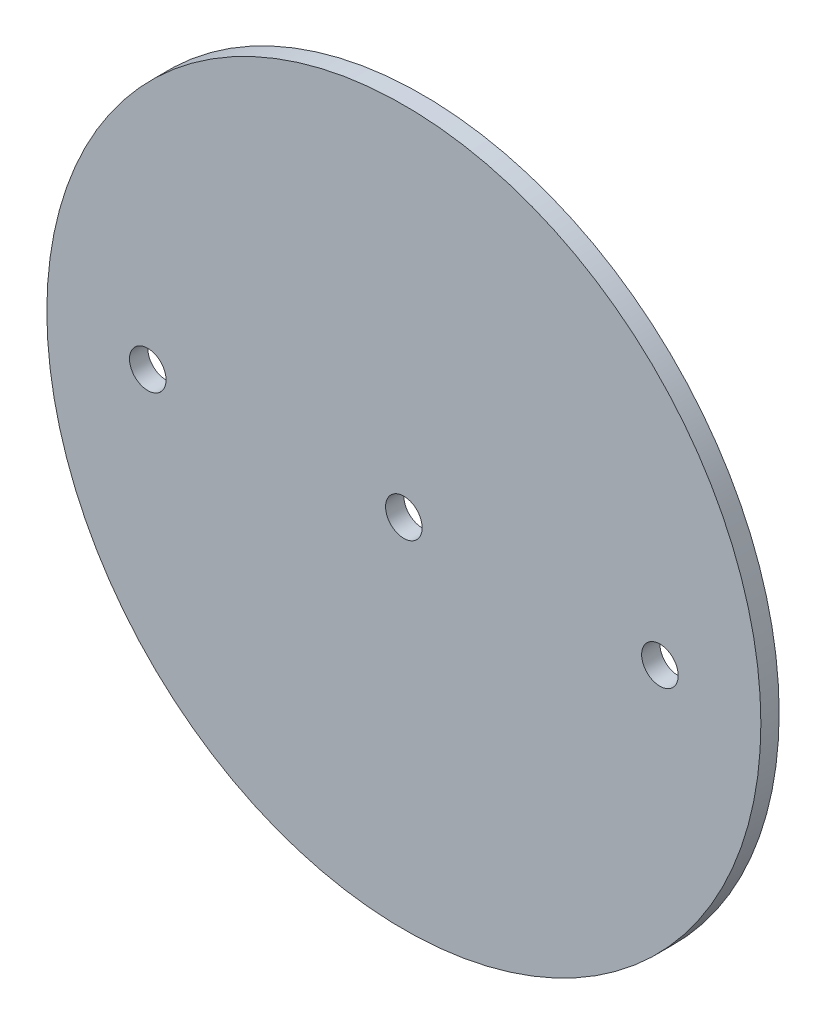
ISO-10303-21;
HEADER;
FILE_DESCRIPTION(('STEP AP214'),'2;1');
FILE_NAME('part.step','',(''),(''),'','','');
FILE_SCHEMA(('AUTOMOTIVE_DESIGN { 1 0 10303 214 1 1 1 1 }'));
ENDSEC;
DATA;
#1=APPLICATION_CONTEXT('core data for automotive mechanical design processes');
#2=APPLICATION_PROTOCOL_DEFINITION('international standard','automotive_design',2000,#1);
#3=PRODUCT_CONTEXT('',#1,'mechanical');
#4=PRODUCT('Part','Part','',(#3));
#5=PRODUCT_RELATED_PRODUCT_CATEGORY('part','',(#4));
#6=PRODUCT_DEFINITION_FORMATION('','',#4);
#7=PRODUCT_DEFINITION_CONTEXT('part definition',#1,'design');
#8=PRODUCT_DEFINITION('design','',#6,#7);
#9=PRODUCT_DEFINITION_SHAPE('','',#8);
#10=(LENGTH_UNIT() NAMED_UNIT(*) SI_UNIT(.MILLI.,.METRE.));
#11=(NAMED_UNIT(*) PLANE_ANGLE_UNIT() SI_UNIT($,.RADIAN.));
#12=(NAMED_UNIT(*) SI_UNIT($,.STERADIAN.) SOLID_ANGLE_UNIT());
#13=UNCERTAINTY_MEASURE_WITH_UNIT(LENGTH_MEASURE(1.E-05),#10,'distance_accuracy_value','');
#14=(GEOMETRIC_REPRESENTATION_CONTEXT(3) GLOBAL_UNCERTAINTY_ASSIGNED_CONTEXT((#13)) GLOBAL_UNIT_ASSIGNED_CONTEXT((#10,
#11,#12)) REPRESENTATION_CONTEXT('',''));
#15=CARTESIAN_POINT('',(0.,0.,0.));
#16=DIRECTION('',(0.,0.,1.));
#17=DIRECTION('',(1.,0.,0.));
#18=AXIS2_PLACEMENT_3D('',#15,#16,#17);
#19=CARTESIAN_POINT('',(0.,0.,1.58750000000007));
#20=DIRECTION('',(0.,0.,-0.999999999999998));
#21=DIRECTION('',(-1.,0.,0.));
#22=AXIS2_PLACEMENT_3D('',#19,#20,#21);
#23=CYLINDRICAL_SURFACE('',#22,61.976);
#24=CARTESIAN_POINT('',(0.,0.,1.58750000000007));
#25=DIRECTION('',(0.,0.,0.999999999999998));
#26=DIRECTION('',(1.,0.,0.));
#27=AXIS2_PLACEMENT_3D('',#24,#25,#26);
#28=CIRCLE('',#27,61.976);
#29=CARTESIAN_POINT('',(61.976,0.,1.58750000000007));
#30=VERTEX_POINT('',#29);
#31=EDGE_CURVE('E10',#30,#30,#28,.T.);
#32=ORIENTED_EDGE('',*,*,#31,.F.);
#33=EDGE_LOOP('',(#32));
#34=FACE_BOUND('',#33,.T.);
#35=CARTESIAN_POINT('',(0.,0.,-1.58750000000007));
#36=DIRECTION('',(0.,0.,0.999999999999998));
#37=DIRECTION('',(1.,0.,0.));
#38=AXIS2_PLACEMENT_3D('',#35,#36,#37);
#39=CIRCLE('',#38,61.976);
#40=CARTESIAN_POINT('',(61.976,0.,-1.58750000000007));
#41=VERTEX_POINT('',#40);
#42=EDGE_CURVE('E42',#41,#41,#39,.T.);
#43=ORIENTED_EDGE('',*,*,#42,.T.);
#44=EDGE_LOOP('',(#43));
#45=FACE_BOUND('',#44,.T.);
#46=ADVANCED_FACE('F39',(#34,#45),#23,.T.);
#47=CARTESIAN_POINT('',(0.,0.,1.58750000000007));
#48=DIRECTION('',(0.,0.,0.999999999999998));
#49=DIRECTION('',(1.,0.,0.));
#50=AXIS2_PLACEMENT_3D('',#47,#48,#49);
#51=PLANE('',#50);
#52=CARTESIAN_POINT('',(0.,0.,1.58750000000007));
#53=DIRECTION('',(0.,0.,0.999999999999998));
#54=DIRECTION('',(1.,0.,0.));
#55=AXIS2_PLACEMENT_3D('',#52,#53,#54);
#56=CIRCLE('',#55,3.17499999999999);
#57=CARTESIAN_POINT('',(3.17499999999999,0.,1.58750000000007));
#58=VERTEX_POINT('',#57);
#59=EDGE_CURVE('E73',#58,#58,#56,.T.);
#60=ORIENTED_EDGE('',*,*,#59,.F.);
#61=EDGE_LOOP('',(#60));
#62=FACE_BOUND('',#61,.T.);
#63=CARTESIAN_POINT('',(44.4500000000004,0.,1.58750000000007));
#64=DIRECTION('',(0.,0.,0.999999999999998));
#65=DIRECTION('',(1.,0.,0.));
#66=AXIS2_PLACEMENT_3D('',#63,#64,#65);
#67=CIRCLE('',#66,3.17499999999998);
#68=CARTESIAN_POINT('',(47.6250000000004,0.,1.58750000000007));
#69=VERTEX_POINT('',#68);
#70=EDGE_CURVE('E65',#69,#69,#67,.T.);
#71=ORIENTED_EDGE('',*,*,#70,.F.);
#72=EDGE_LOOP('',(#71));
#73=FACE_BOUND('',#72,.T.);
#74=CARTESIAN_POINT('',(-44.4500000000001,6.66133814775094E-13,1.58750000000007));
#75=DIRECTION('',(0.,0.,0.999999999999998));
#76=DIRECTION('',(1.,0.,0.));
#77=AXIS2_PLACEMENT_3D('',#74,#75,#76);
#78=CIRCLE('',#77,3.17499999999999);
#79=CARTESIAN_POINT('',(-41.2750000000001,6.66133814775094E-13,1.58750000000007));
#80=VERTEX_POINT('',#79);
#81=EDGE_CURVE('E57',#80,#80,#78,.T.);
#82=ORIENTED_EDGE('',*,*,#81,.F.);
#83=EDGE_LOOP('',(#82));
#84=FACE_BOUND('',#83,.T.);
#85=ORIENTED_EDGE('',*,*,#31,.T.);
#86=EDGE_LOOP('',(#85));
#87=FACE_BOUND('',#86,.T.);
#88=ADVANCED_FACE('F81',(#62,#73,#84,#87),#51,.T.);
#89=CARTESIAN_POINT('',(0.,0.,-1.58750000000007));
#90=DIRECTION('',(0.,0.,0.999999999999998));
#91=DIRECTION('',(1.,0.,0.));
#92=AXIS2_PLACEMENT_3D('',#89,#90,#91);
#93=PLANE('',#92);
#94=CARTESIAN_POINT('',(0.,0.,-1.58750000000007));
#95=DIRECTION('',(0.,0.,0.999999999999998));
#96=DIRECTION('',(1.,0.,0.));
#97=AXIS2_PLACEMENT_3D('',#94,#95,#96);
#98=CIRCLE('',#97,3.17499999999999);
#99=CARTESIAN_POINT('',(3.17499999999999,0.,-1.58750000000007));
#100=VERTEX_POINT('',#99);
#101=EDGE_CURVE('E69',#100,#100,#98,.T.);
#102=ORIENTED_EDGE('',*,*,#101,.T.);
#103=EDGE_LOOP('',(#102));
#104=FACE_BOUND('',#103,.T.);
#105=CARTESIAN_POINT('',(44.4500000000004,0.,-1.58750000000007));
#106=DIRECTION('',(0.,0.,0.999999999999998));
#107=DIRECTION('',(1.,0.,0.));
#108=AXIS2_PLACEMENT_3D('',#105,#106,#107);
#109=CIRCLE('',#108,3.17499999999999);
#110=CARTESIAN_POINT('',(47.6250000000004,0.,-1.58750000000007));
#111=VERTEX_POINT('',#110);
#112=EDGE_CURVE('E61',#111,#111,#109,.T.);
#113=ORIENTED_EDGE('',*,*,#112,.T.);
#114=EDGE_LOOP('',(#113));
#115=FACE_BOUND('',#114,.T.);
#116=CARTESIAN_POINT('',(-44.4500000000001,6.66133814775094E-13,-1.58750000000007));
#117=DIRECTION('',(0.,0.,0.999999999999998));
#118=DIRECTION('',(1.,0.,0.));
#119=AXIS2_PLACEMENT_3D('',#116,#117,#118);
#120=CIRCLE('',#119,3.17499999999999);
#121=CARTESIAN_POINT('',(-41.2750000000001,6.66133814775094E-13,-1.58750000000007));
#122=VERTEX_POINT('',#121);
#123=EDGE_CURVE('E52',#122,#122,#120,.T.);
#124=ORIENTED_EDGE('',*,*,#123,.T.);
#125=EDGE_LOOP('',(#124));
#126=FACE_BOUND('',#125,.T.);
#127=ORIENTED_EDGE('',*,*,#42,.F.);
#128=EDGE_LOOP('',(#127));
#129=FACE_BOUND('',#128,.T.);
#130=ADVANCED_FACE('F84',(#104,#115,#126,#129),#93,.F.);
#131=CARTESIAN_POINT('',(-44.4500000000001,6.66133814775094E-13,1.58750000000007));
#132=DIRECTION('',(0.,0.,0.999999999999998));
#133=DIRECTION('',(1.,0.,0.));
#134=AXIS2_PLACEMENT_3D('',#131,#132,#133);
#135=CYLINDRICAL_SURFACE('',#134,3.17499999999999);
#136=ORIENTED_EDGE('',*,*,#123,.F.);
#137=EDGE_LOOP('',(#136));
#138=FACE_BOUND('',#137,.T.);
#139=ORIENTED_EDGE('',*,*,#81,.T.);
#140=EDGE_LOOP('',(#139));
#141=FACE_BOUND('',#140,.T.);
#142=ADVANCED_FACE('F90',(#138,#141),#135,.F.);
#143=CARTESIAN_POINT('',(44.4500000000004,0.,1.58750000000007));
#144=DIRECTION('',(0.,0.,0.999999999999998));
#145=DIRECTION('',(1.,0.,0.));
#146=AXIS2_PLACEMENT_3D('',#143,#144,#145);
#147=CYLINDRICAL_SURFACE('',#146,3.17499999999999);
#148=ORIENTED_EDGE('',*,*,#112,.F.);
#149=EDGE_LOOP('',(#148));
#150=FACE_BOUND('',#149,.T.);
#151=ORIENTED_EDGE('',*,*,#70,.T.);
#152=EDGE_LOOP('',(#151));
#153=FACE_BOUND('',#152,.T.);
#154=ADVANCED_FACE('F92',(#150,#153),#147,.F.);
#155=CARTESIAN_POINT('',(0.,0.,1.58750000000007));
#156=DIRECTION('',(0.,0.,0.999999999999998));
#157=DIRECTION('',(1.,0.,0.));
#158=AXIS2_PLACEMENT_3D('',#155,#156,#157);
#159=CYLINDRICAL_SURFACE('',#158,3.17499999999999);
#160=ORIENTED_EDGE('',*,*,#101,.F.);
#161=EDGE_LOOP('',(#160));
#162=FACE_BOUND('',#161,.T.);
#163=ORIENTED_EDGE('',*,*,#59,.T.);
#164=EDGE_LOOP('',(#163));
#165=FACE_BOUND('',#164,.T.);
#166=ADVANCED_FACE('F79',(#162,#165),#159,.F.);
#167=CLOSED_SHELL('',(#46,#88,#130,#142,#154,#166));
#168=MANIFOLD_SOLID_BREP('B2',#167);
#169=ADVANCED_BREP_SHAPE_REPRESENTATION('',(#18,#168),#14);
#170=SHAPE_DEFINITION_REPRESENTATION(#9,#169);
ENDSEC;
END-ISO-10303-21;
